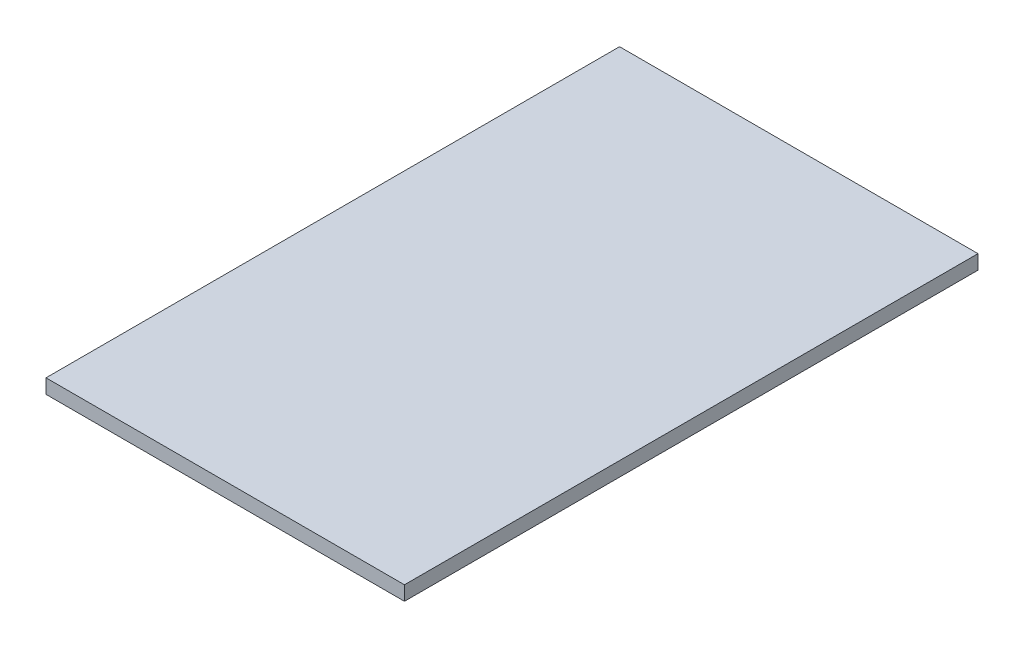
ISO-10303-21;
HEADER;
FILE_DESCRIPTION(('STEP AP214'),'2;1');
FILE_NAME('part.step','',(''),(''),'','','');
FILE_SCHEMA(('AUTOMOTIVE_DESIGN { 1 0 10303 214 1 1 1 1 }'));
ENDSEC;
DATA;
#1=APPLICATION_CONTEXT('core data for automotive mechanical design processes');
#2=APPLICATION_PROTOCOL_DEFINITION('international standard','automotive_design',2000,#1);
#3=PRODUCT_CONTEXT('',#1,'mechanical');
#4=PRODUCT('Part','Part','',(#3));
#5=PRODUCT_RELATED_PRODUCT_CATEGORY('part','',(#4));
#6=PRODUCT_DEFINITION_FORMATION('','',#4);
#7=PRODUCT_DEFINITION_CONTEXT('part definition',#1,'design');
#8=PRODUCT_DEFINITION('design','',#6,#7);
#9=PRODUCT_DEFINITION_SHAPE('','',#8);
#10=(LENGTH_UNIT() NAMED_UNIT(*) SI_UNIT(.MILLI.,.METRE.));
#11=(NAMED_UNIT(*) PLANE_ANGLE_UNIT() SI_UNIT($,.RADIAN.));
#12=(NAMED_UNIT(*) SI_UNIT($,.STERADIAN.) SOLID_ANGLE_UNIT());
#13=UNCERTAINTY_MEASURE_WITH_UNIT(LENGTH_MEASURE(1.E-05),#10,'distance_accuracy_value','');
#14=(GEOMETRIC_REPRESENTATION_CONTEXT(3) GLOBAL_UNCERTAINTY_ASSIGNED_CONTEXT((#13)) GLOBAL_UNIT_ASSIGNED_CONTEXT((#10,
#11,#12)) REPRESENTATION_CONTEXT('',''));
#15=CARTESIAN_POINT('',(0.,0.,0.));
#16=DIRECTION('',(0.,0.,1.));
#17=DIRECTION('',(1.,0.,0.));
#18=AXIS2_PLACEMENT_3D('',#15,#16,#17);
#19=CARTESIAN_POINT('',(0.,-0.25,0.));
#20=DIRECTION('',(0.,-1.,0.));
#21=DIRECTION('',(0.,0.,-1.));
#22=AXIS2_PLACEMENT_3D('',#19,#20,#21);
#23=PLANE('',#22);
#24=DIRECTION('',(0.,0.,-1.));
#25=VECTOR('',#24,1.);
#26=CARTESIAN_POINT('',(2.45,-0.25,1.));
#27=LINE('',#26,#25);
#28=CARTESIAN_POINT('',(2.45,-0.25,1.));
#29=VERTEX_POINT('',#28);
#30=CARTESIAN_POINT('',(2.45,-0.25,-1.));
#31=VERTEX_POINT('',#30);
#32=EDGE_CURVE('E68',#29,#31,#27,.T.);
#33=ORIENTED_EDGE('',*,*,#32,.F.);
#34=DIRECTION('',(1.,0.,0.));
#35=VECTOR('',#34,1.);
#36=CARTESIAN_POINT('',(1.2,-0.25,1.));
#37=LINE('',#36,#35);
#38=CARTESIAN_POINT('',(1.2,-0.25,1.));
#39=VERTEX_POINT('',#38);
#40=EDGE_CURVE('E55',#39,#29,#37,.T.);
#41=ORIENTED_EDGE('',*,*,#40,.F.);
#42=DIRECTION('',(0.,0.,1.));
#43=VECTOR('',#42,1.);
#44=CARTESIAN_POINT('',(1.2,-0.25,1.));
#45=LINE('',#44,#43);
#46=CARTESIAN_POINT('',(1.2,-0.25,-1.));
#47=VERTEX_POINT('',#46);
#48=EDGE_CURVE('E61',#47,#39,#45,.T.);
#49=ORIENTED_EDGE('',*,*,#48,.F.);
#50=DIRECTION('',(1.,0.,0.));
#51=VECTOR('',#50,1.);
#52=CARTESIAN_POINT('',(0.,-0.25,-1.));
#53=LINE('',#52,#51);
#54=EDGE_CURVE('E19',#47,#31,#53,.T.);
#55=ORIENTED_EDGE('',*,*,#54,.T.);
#56=EDGE_LOOP('',(#33,#41,#49,#55));
#57=FACE_BOUND('',#56,.T.);
#58=ADVANCED_FACE('F16',(#57),#23,.T.);
#59=CARTESIAN_POINT('',(1.2,2.158495283014,1.));
#60=DIRECTION('',(-1.,0.,0.));
#61=DIRECTION('',(0.,0.,1.));
#62=AXIS2_PLACEMENT_3D('',#59,#60,#61);
#63=PLANE('',#62);
#64=DIRECTION('',(0.,1.,0.));
#65=VECTOR('',#64,1.);
#66=CARTESIAN_POINT('',(1.2,2.158495283014,-1.));
#67=LINE('',#66,#65);
#68=CARTESIAN_POINT('',(1.2,-0.2,-1.));
#69=VERTEX_POINT('',#68);
#70=EDGE_CURVE('E66',#47,#69,#67,.T.);
#71=ORIENTED_EDGE('',*,*,#70,.F.);
#72=ORIENTED_EDGE('',*,*,#48,.T.);
#73=DIRECTION('',(0.,1.,0.));
#74=VECTOR('',#73,1.);
#75=CARTESIAN_POINT('',(1.2,2.158495283014,1.));
#76=LINE('',#75,#74);
#77=CARTESIAN_POINT('',(1.2,-0.2,1.));
#78=VERTEX_POINT('',#77);
#79=EDGE_CURVE('E63',#78,#39,#76,.F.);
#80=ORIENTED_EDGE('',*,*,#79,.F.);
#81=DIRECTION('',(0.,0.,1.));
#82=VECTOR('',#81,1.);
#83=CARTESIAN_POINT('',(1.2,-0.2,0.));
#84=LINE('',#83,#82);
#85=EDGE_CURVE('E82',#69,#78,#84,.T.);
#86=ORIENTED_EDGE('',*,*,#85,.F.);
#87=EDGE_LOOP('',(#71,#72,#80,#86));
#88=FACE_BOUND('',#87,.T.);
#89=ADVANCED_FACE('F62',(#88),#63,.T.);
#90=CARTESIAN_POINT('',(1.2,2.158495283014,1.));
#91=DIRECTION('',(0.,0.,1.));
#92=DIRECTION('',(1.,0.,0.));
#93=AXIS2_PLACEMENT_3D('',#90,#91,#92);
#94=PLANE('',#93);
#95=ORIENTED_EDGE('',*,*,#79,.T.);
#96=ORIENTED_EDGE('',*,*,#40,.T.);
#97=DIRECTION('',(0.,1.,0.));
#98=VECTOR('',#97,1.);
#99=CARTESIAN_POINT('',(2.45,2.158495283014,1.));
#100=LINE('',#99,#98);
#101=CARTESIAN_POINT('',(2.45,-0.2,1.));
#102=VERTEX_POINT('',#101);
#103=EDGE_CURVE('E70',#102,#29,#100,.F.);
#104=ORIENTED_EDGE('',*,*,#103,.F.);
#105=DIRECTION('',(1.,0.,0.));
#106=VECTOR('',#105,1.);
#107=CARTESIAN_POINT('',(0.,-0.2,1.));
#108=LINE('',#107,#106);
#109=EDGE_CURVE('E74',#78,#102,#108,.T.);
#110=ORIENTED_EDGE('',*,*,#109,.F.);
#111=EDGE_LOOP('',(#95,#96,#104,#110));
#112=FACE_BOUND('',#111,.T.);
#113=ADVANCED_FACE('F72',(#112),#94,.T.);
#114=CARTESIAN_POINT('',(2.45,2.158495283014,1.));
#115=DIRECTION('',(1.,0.,0.));
#116=DIRECTION('',(0.,0.,-1.));
#117=AXIS2_PLACEMENT_3D('',#114,#115,#116);
#118=PLANE('',#117);
#119=ORIENTED_EDGE('',*,*,#103,.T.);
#120=ORIENTED_EDGE('',*,*,#32,.T.);
#121=DIRECTION('',(0.,1.,0.));
#122=VECTOR('',#121,1.);
#123=CARTESIAN_POINT('',(2.45,2.158495283014,-1.));
#124=LINE('',#123,#122);
#125=CARTESIAN_POINT('',(2.45,-0.2,-1.));
#126=VERTEX_POINT('',#125);
#127=EDGE_CURVE('E34',#126,#31,#124,.F.);
#128=ORIENTED_EDGE('',*,*,#127,.F.);
#129=DIRECTION('',(0.,0.,1.));
#130=VECTOR('',#129,1.);
#131=CARTESIAN_POINT('',(2.45,-0.2,0.));
#132=LINE('',#131,#130);
#133=EDGE_CURVE('E25',#102,#126,#132,.F.);
#134=ORIENTED_EDGE('',*,*,#133,.F.);
#135=EDGE_LOOP('',(#119,#120,#128,#134));
#136=FACE_BOUND('',#135,.T.);
#137=ADVANCED_FACE('F88',(#136),#118,.T.);
#138=CARTESIAN_POINT('',(1.2,2.158495283014,-1.));
#139=DIRECTION('',(0.,0.,-1.));
#140=DIRECTION('',(-1.,0.,0.));
#141=AXIS2_PLACEMENT_3D('',#138,#139,#140);
#142=PLANE('',#141);
#143=ORIENTED_EDGE('',*,*,#127,.T.);
#144=ORIENTED_EDGE('',*,*,#54,.F.);
#145=ORIENTED_EDGE('',*,*,#70,.T.);
#146=DIRECTION('',(1.,0.,0.));
#147=VECTOR('',#146,1.);
#148=CARTESIAN_POINT('',(0.,-0.2,-1.));
#149=LINE('',#148,#147);
#150=EDGE_CURVE('E11',#126,#69,#149,.F.);
#151=ORIENTED_EDGE('',*,*,#150,.F.);
#152=EDGE_LOOP('',(#143,#144,#145,#151));
#153=FACE_BOUND('',#152,.T.);
#154=ADVANCED_FACE('F90',(#153),#142,.T.);
#155=CARTESIAN_POINT('',(0.,-0.2,0.));
#156=DIRECTION('',(0.,1.,0.));
#157=DIRECTION('',(0.,0.,1.));
#158=AXIS2_PLACEMENT_3D('',#155,#156,#157);
#159=PLANE('',#158);
#160=ORIENTED_EDGE('',*,*,#133,.T.);
#161=ORIENTED_EDGE('',*,*,#150,.T.);
#162=ORIENTED_EDGE('',*,*,#85,.T.);
#163=ORIENTED_EDGE('',*,*,#109,.T.);
#164=EDGE_LOOP('',(#160,#161,#162,#163));
#165=FACE_BOUND('',#164,.T.);
#166=ADVANCED_FACE('F87',(#165),#159,.T.);
#167=CLOSED_SHELL('',(#58,#89,#113,#137,#154,#166));
#168=MANIFOLD_SOLID_BREP('B1',#167);
#169=ADVANCED_BREP_SHAPE_REPRESENTATION('',(#18,#168),#14);
#170=SHAPE_DEFINITION_REPRESENTATION(#9,#169);
ENDSEC;
END-ISO-10303-21;
